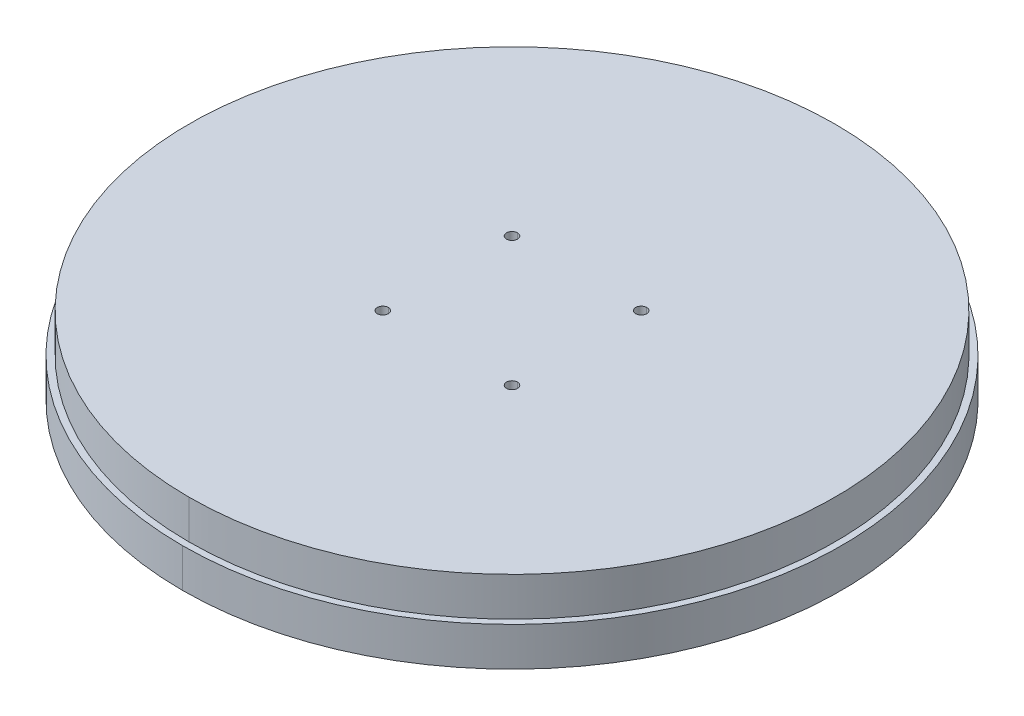
ISO-10303-21;
HEADER;
FILE_DESCRIPTION(('STEP AP214'),'2;1');
FILE_NAME('part.step','',(''),(''),'','','');
FILE_SCHEMA(('AUTOMOTIVE_DESIGN { 1 0 10303 214 1 1 1 1 }'));
ENDSEC;
DATA;
#1=APPLICATION_CONTEXT('core data for automotive mechanical design processes');
#2=APPLICATION_PROTOCOL_DEFINITION('international standard','automotive_design',2000,#1);
#3=PRODUCT_CONTEXT('',#1,'mechanical');
#4=PRODUCT('Part','Part','',(#3));
#5=PRODUCT_RELATED_PRODUCT_CATEGORY('part','',(#4));
#6=PRODUCT_DEFINITION_FORMATION('','',#4);
#7=PRODUCT_DEFINITION_CONTEXT('part definition',#1,'design');
#8=PRODUCT_DEFINITION('design','',#6,#7);
#9=PRODUCT_DEFINITION_SHAPE('','',#8);
#10=(LENGTH_UNIT() NAMED_UNIT(*) SI_UNIT(.MILLI.,.METRE.));
#11=(NAMED_UNIT(*) PLANE_ANGLE_UNIT() SI_UNIT($,.RADIAN.));
#12=(NAMED_UNIT(*) SI_UNIT($,.STERADIAN.) SOLID_ANGLE_UNIT());
#13=UNCERTAINTY_MEASURE_WITH_UNIT(LENGTH_MEASURE(1.E-05),#10,'distance_accuracy_value','');
#14=(GEOMETRIC_REPRESENTATION_CONTEXT(3) GLOBAL_UNCERTAINTY_ASSIGNED_CONTEXT((#13)) GLOBAL_UNIT_ASSIGNED_CONTEXT((#10,
#11,#12)) REPRESENTATION_CONTEXT('',''));
#15=CARTESIAN_POINT('',(0.,0.,0.));
#16=DIRECTION('',(0.,0.,1.));
#17=DIRECTION('',(1.,0.,0.));
#18=AXIS2_PLACEMENT_3D('',#15,#16,#17);
#19=CARTESIAN_POINT('',(202.09950971272,0.,-65.6661113046786));
#20=DIRECTION('',(0.,-1.,0.));
#21=DIRECTION('',(0.,0.,-1.));
#22=AXIS2_PLACEMENT_3D('',#19,#20,#21);
#23=CYLINDRICAL_SURFACE('',#22,5.1);
#24=CARTESIAN_POINT('',(202.09950971272,25.,-65.6661113046786));
#25=DIRECTION('',(0.,-1.,0.));
#26=DIRECTION('',(0.,0.,-1.));
#27=AXIS2_PLACEMENT_3D('',#24,#25,#26);
#28=CIRCLE('',#27,5.1);
#29=CARTESIAN_POINT('',(202.09950971272,25.,-60.5661113046786));
#30=VERTEX_POINT('',#29);
#31=CARTESIAN_POINT('',(202.09950971272,25.,-70.7661113046786));
#32=VERTEX_POINT('',#31);
#33=EDGE_CURVE('E41',#30,#32,#28,.T.);
#34=ORIENTED_EDGE('',*,*,#33,.F.);
#35=DIRECTION('',(0.,-1.,0.));
#36=VECTOR('',#35,1.);
#37=CARTESIAN_POINT('',(202.09950971272,0.,-60.5661113046786));
#38=LINE('',#37,#36);
#39=CARTESIAN_POINT('',(202.09950971272,0.,-60.5661113046786));
#40=VERTEX_POINT('',#39);
#41=EDGE_CURVE('E11',#30,#40,#38,.T.);
#42=ORIENTED_EDGE('',*,*,#41,.T.);
#43=CARTESIAN_POINT('',(202.09950971272,0.,-65.6661113046786));
#44=DIRECTION('',(0.,-1.,0.));
#45=DIRECTION('',(0.,0.,-1.));
#46=AXIS2_PLACEMENT_3D('',#43,#44,#45);
#47=CIRCLE('',#46,5.1);
#48=CARTESIAN_POINT('',(202.09950971272,0.,-70.7661113046786));
#49=VERTEX_POINT('',#48);
#50=EDGE_CURVE('E27',#40,#49,#47,.T.);
#51=ORIENTED_EDGE('',*,*,#50,.T.);
#52=DIRECTION('',(0.,-1.,0.));
#53=VECTOR('',#52,1.);
#54=CARTESIAN_POINT('',(202.09950971272,0.,-70.7661113046786));
#55=LINE('',#54,#53);
#56=EDGE_CURVE('E273',#32,#49,#55,.T.);
#57=ORIENTED_EDGE('',*,*,#56,.F.);
#58=EDGE_LOOP('',(#34,#42,#51,#57));
#59=FACE_BOUND('',#58,.T.);
#60=ADVANCED_FACE('F16',(#59),#23,.F.);
#61=CARTESIAN_POINT('',(202.09950971272,25.,-65.6661113046786));
#62=DIRECTION('',(0.,-1.,0.));
#63=DIRECTION('',(0.,0.,-1.));
#64=AXIS2_PLACEMENT_3D('',#61,#62,#63);
#65=CONICAL_SURFACE('',#64,5.1,1.02974425867665);
#66=DIRECTION('',(0.,-0.515038074910055,-0.857167300702112));
#67=VECTOR('',#66,1.);
#68=CARTESIAN_POINT('',(202.09950971272,25.,-70.7661113046786));
#69=LINE('',#68,#67);
#70=CARTESIAN_POINT('',(202.09950971272,28.0643891570405,-65.6661113046786));
#71=VERTEX_POINT('',#70);
#72=EDGE_CURVE('E147',#71,#32,#69,.T.);
#73=ORIENTED_EDGE('',*,*,#72,.F.);
#74=DIRECTION('',(0.,-0.515038074910055,0.857167300702112));
#75=VECTOR('',#74,1.);
#76=CARTESIAN_POINT('',(202.09950971272,25.,-60.5661113046786));
#77=LINE('',#76,#75);
#78=EDGE_CURVE('E285',#71,#30,#77,.T.);
#79=ORIENTED_EDGE('',*,*,#78,.T.);
#80=ORIENTED_EDGE('',*,*,#33,.T.);
#81=EDGE_LOOP('',(#73,#79,#80));
#82=FACE_BOUND('',#81,.T.);
#83=ADVANCED_FACE('F599',(#82),#65,.F.);
#84=CARTESIAN_POINT('',(124.904366112152,0.,171.916111304675));
#85=DIRECTION('',(0.,-1.,0.));
#86=DIRECTION('',(0.,0.,-1.));
#87=AXIS2_PLACEMENT_3D('',#84,#85,#86);
#88=CYLINDRICAL_SURFACE('',#87,5.1);
#89=CARTESIAN_POINT('',(124.904366112152,25.,171.916111304675));
#90=DIRECTION('',(0.,-1.,0.));
#91=DIRECTION('',(0.,0.,-1.));
#92=AXIS2_PLACEMENT_3D('',#89,#90,#91);
#93=CIRCLE('',#92,5.1);
#94=CARTESIAN_POINT('',(124.904366112152,25.,177.016111304675));
#95=VERTEX_POINT('',#94);
#96=CARTESIAN_POINT('',(124.904366112152,25.,166.816111304675));
#97=VERTEX_POINT('',#96);
#98=EDGE_CURVE('E161',#95,#97,#93,.T.);
#99=ORIENTED_EDGE('',*,*,#98,.F.);
#100=DIRECTION('',(0.,-1.,0.));
#101=VECTOR('',#100,1.);
#102=CARTESIAN_POINT('',(124.904366112152,0.,177.016111304675));
#103=LINE('',#102,#101);
#104=CARTESIAN_POINT('',(124.904366112152,0.,177.016111304675));
#105=VERTEX_POINT('',#104);
#106=EDGE_CURVE('E396',#95,#105,#103,.T.);
#107=ORIENTED_EDGE('',*,*,#106,.T.);
#108=CARTESIAN_POINT('',(124.904366112152,0.,171.916111304675));
#109=DIRECTION('',(0.,-1.,0.));
#110=DIRECTION('',(0.,0.,-1.));
#111=AXIS2_PLACEMENT_3D('',#108,#109,#110);
#112=CIRCLE('',#111,5.1);
#113=CARTESIAN_POINT('',(124.904366112152,0.,166.816111304675));
#114=VERTEX_POINT('',#113);
#115=EDGE_CURVE('E399',#105,#114,#112,.T.);
#116=ORIENTED_EDGE('',*,*,#115,.T.);
#117=DIRECTION('',(0.,-1.,0.));
#118=VECTOR('',#117,1.);
#119=CARTESIAN_POINT('',(124.904366112152,0.,166.816111304675));
#120=LINE('',#119,#118);
#121=EDGE_CURVE('E524',#97,#114,#120,.T.);
#122=ORIENTED_EDGE('',*,*,#121,.F.);
#123=EDGE_LOOP('',(#99,#107,#116,#122));
#124=FACE_BOUND('',#123,.T.);
#125=ADVANCED_FACE('F605',(#124),#88,.F.);
#126=CARTESIAN_POINT('',(124.904366112152,25.,171.916111304675));
#127=DIRECTION('',(0.,-1.,0.));
#128=DIRECTION('',(0.,0.,-1.));
#129=AXIS2_PLACEMENT_3D('',#126,#127,#128);
#130=CONICAL_SURFACE('',#129,5.1,1.02974425867665);
#131=DIRECTION('',(0.,-0.515038074910055,-0.857167300702112));
#132=VECTOR('',#131,1.);
#133=CARTESIAN_POINT('',(124.904366112152,25.,166.816111304675));
#134=LINE('',#133,#132);
#135=CARTESIAN_POINT('',(124.904366112152,28.0643891570405,171.916111304675));
#136=VERTEX_POINT('',#135);
#137=EDGE_CURVE('E499',#136,#97,#134,.T.);
#138=ORIENTED_EDGE('',*,*,#137,.F.);
#139=DIRECTION('',(0.,-0.515038074910055,0.857167300702112));
#140=VECTOR('',#139,1.);
#141=CARTESIAN_POINT('',(124.904366112152,25.,177.016111304675));
#142=LINE('',#141,#140);
#143=EDGE_CURVE('E520',#136,#95,#142,.T.);
#144=ORIENTED_EDGE('',*,*,#143,.T.);
#145=ORIENTED_EDGE('',*,*,#98,.T.);
#146=EDGE_LOOP('',(#138,#144,#145));
#147=FACE_BOUND('',#146,.T.);
#148=ADVANCED_FACE('F792',(#147),#130,.F.);
#149=CARTESIAN_POINT('',(-124.90436611215,0.,171.916111304677));
#150=DIRECTION('',(0.,-1.,0.));
#151=DIRECTION('',(0.,0.,-1.));
#152=AXIS2_PLACEMENT_3D('',#149,#150,#151);
#153=CYLINDRICAL_SURFACE('',#152,5.1);
#154=CARTESIAN_POINT('',(-124.90436611215,25.,171.916111304677));
#155=DIRECTION('',(0.,-1.,0.));
#156=DIRECTION('',(0.,0.,-1.));
#157=AXIS2_PLACEMENT_3D('',#154,#155,#156);
#158=CIRCLE('',#157,5.1);
#159=CARTESIAN_POINT('',(-124.90436611215,25.,177.016111304677));
#160=VERTEX_POINT('',#159);
#161=CARTESIAN_POINT('',(-124.90436611215,25.,166.816111304677));
#162=VERTEX_POINT('',#161);
#163=EDGE_CURVE('E420',#160,#162,#158,.T.);
#164=ORIENTED_EDGE('',*,*,#163,.F.);
#165=DIRECTION('',(0.,-1.,0.));
#166=VECTOR('',#165,1.);
#167=CARTESIAN_POINT('',(-124.90436611215,0.,177.016111304677));
#168=LINE('',#167,#166);
#169=CARTESIAN_POINT('',(-124.90436611215,0.,177.016111304677));
#170=VERTEX_POINT('',#169);
#171=EDGE_CURVE('E445',#160,#170,#168,.T.);
#172=ORIENTED_EDGE('',*,*,#171,.T.);
#173=CARTESIAN_POINT('',(-124.90436611215,0.,171.916111304677));
#174=DIRECTION('',(0.,-1.,0.));
#175=DIRECTION('',(0.,0.,-1.));
#176=AXIS2_PLACEMENT_3D('',#173,#174,#175);
#177=CIRCLE('',#176,5.1);
#178=CARTESIAN_POINT('',(-124.90436611215,0.,166.816111304677));
#179=VERTEX_POINT('',#178);
#180=EDGE_CURVE('E419',#170,#179,#177,.T.);
#181=ORIENTED_EDGE('',*,*,#180,.T.);
#182=DIRECTION('',(0.,-1.,0.));
#183=VECTOR('',#182,1.);
#184=CARTESIAN_POINT('',(-124.90436611215,0.,166.816111304677));
#185=LINE('',#184,#183);
#186=EDGE_CURVE('E455',#162,#179,#185,.T.);
#187=ORIENTED_EDGE('',*,*,#186,.F.);
#188=EDGE_LOOP('',(#164,#172,#181,#187));
#189=FACE_BOUND('',#188,.T.);
#190=ADVANCED_FACE('F788',(#189),#153,.F.);
#191=CARTESIAN_POINT('',(-124.90436611215,25.,171.916111304677));
#192=DIRECTION('',(0.,-1.,0.));
#193=DIRECTION('',(0.,0.,-1.));
#194=AXIS2_PLACEMENT_3D('',#191,#192,#193);
#195=CONICAL_SURFACE('',#194,5.1,1.02974425867665);
#196=DIRECTION('',(0.,-0.515038074910055,-0.857167300702112));
#197=VECTOR('',#196,1.);
#198=CARTESIAN_POINT('',(-124.90436611215,25.,166.816111304677));
#199=LINE('',#198,#197);
#200=CARTESIAN_POINT('',(-124.90436611215,28.0643891570405,171.916111304677));
#201=VERTEX_POINT('',#200);
#202=EDGE_CURVE('E482',#201,#162,#199,.T.);
#203=ORIENTED_EDGE('',*,*,#202,.F.);
#204=DIRECTION('',(0.,-0.515038074910055,0.857167300702112));
#205=VECTOR('',#204,1.);
#206=CARTESIAN_POINT('',(-124.90436611215,25.,177.016111304677));
#207=LINE('',#206,#205);
#208=EDGE_CURVE('E415',#201,#160,#207,.T.);
#209=ORIENTED_EDGE('',*,*,#208,.T.);
#210=ORIENTED_EDGE('',*,*,#163,.T.);
#211=EDGE_LOOP('',(#203,#209,#210));
#212=FACE_BOUND('',#211,.T.);
#213=ADVANCED_FACE('F659',(#212),#195,.F.);
#214=CARTESIAN_POINT('',(-202.099509712721,0.,-65.6661113046758));
#215=DIRECTION('',(0.,-1.,0.));
#216=DIRECTION('',(0.,0.,-1.));
#217=AXIS2_PLACEMENT_3D('',#214,#215,#216);
#218=CYLINDRICAL_SURFACE('',#217,5.1);
#219=CARTESIAN_POINT('',(-202.099509712721,25.,-65.6661113046758));
#220=DIRECTION('',(0.,-1.,0.));
#221=DIRECTION('',(0.,0.,-1.));
#222=AXIS2_PLACEMENT_3D('',#219,#220,#221);
#223=CIRCLE('',#222,5.1);
#224=CARTESIAN_POINT('',(-202.099509712721,25.,-60.5661113046758));
#225=VERTEX_POINT('',#224);
#226=CARTESIAN_POINT('',(-202.099509712721,25.,-70.7661113046758));
#227=VERTEX_POINT('',#226);
#228=EDGE_CURVE('E319',#225,#227,#223,.T.);
#229=ORIENTED_EDGE('',*,*,#228,.F.);
#230=DIRECTION('',(0.,-1.,0.));
#231=VECTOR('',#230,1.);
#232=CARTESIAN_POINT('',(-202.099509712721,0.,-60.5661113046758));
#233=LINE('',#232,#231);
#234=CARTESIAN_POINT('',(-202.099509712721,0.,-60.5661113046758));
#235=VERTEX_POINT('',#234);
#236=EDGE_CURVE('E405',#225,#235,#233,.T.);
#237=ORIENTED_EDGE('',*,*,#236,.T.);
#238=CARTESIAN_POINT('',(-202.099509712721,0.,-65.6661113046758));
#239=DIRECTION('',(0.,-1.,0.));
#240=DIRECTION('',(0.,0.,-1.));
#241=AXIS2_PLACEMENT_3D('',#238,#239,#240);
#242=CIRCLE('',#241,5.1);
#243=CARTESIAN_POINT('',(-202.099509712721,0.,-70.7661113046758));
#244=VERTEX_POINT('',#243);
#245=EDGE_CURVE('E318',#235,#244,#242,.T.);
#246=ORIENTED_EDGE('',*,*,#245,.T.);
#247=DIRECTION('',(0.,-1.,0.));
#248=VECTOR('',#247,1.);
#249=CARTESIAN_POINT('',(-202.099509712721,0.,-70.7661113046758));
#250=LINE('',#249,#248);
#251=EDGE_CURVE('E432',#227,#244,#250,.T.);
#252=ORIENTED_EDGE('',*,*,#251,.F.);
#253=EDGE_LOOP('',(#229,#237,#246,#252));
#254=FACE_BOUND('',#253,.T.);
#255=ADVANCED_FACE('F649',(#254),#218,.F.);
#256=CARTESIAN_POINT('',(-202.099509712721,25.,-65.6661113046758));
#257=DIRECTION('',(0.,-1.,0.));
#258=DIRECTION('',(0.,0.,-1.));
#259=AXIS2_PLACEMENT_3D('',#256,#257,#258);
#260=CONICAL_SURFACE('',#259,5.1,1.02974425867665);
#261=DIRECTION('',(0.,-0.515038074910055,-0.857167300702112));
#262=VECTOR('',#261,1.);
#263=CARTESIAN_POINT('',(-202.099509712721,25.,-70.7661113046758));
#264=LINE('',#263,#262);
#265=CARTESIAN_POINT('',(-202.099509712721,28.0643891570405,-65.6661113046758));
#266=VERTEX_POINT('',#265);
#267=EDGE_CURVE('E365',#266,#227,#264,.T.);
#268=ORIENTED_EDGE('',*,*,#267,.F.);
#269=DIRECTION('',(0.,-0.515038074910055,0.857167300702112));
#270=VECTOR('',#269,1.);
#271=CARTESIAN_POINT('',(-202.099509712721,25.,-60.5661113046758));
#272=LINE('',#271,#270);
#273=EDGE_CURVE('E314',#266,#225,#272,.T.);
#274=ORIENTED_EDGE('',*,*,#273,.T.);
#275=ORIENTED_EDGE('',*,*,#228,.T.);
#276=EDGE_LOOP('',(#268,#274,#275));
#277=FACE_BOUND('',#276,.T.);
#278=ADVANCED_FACE('F646',(#277),#260,.F.);
#279=CARTESIAN_POINT('',(0.,0.,-212.5));
#280=DIRECTION('',(0.,-1.,0.));
#281=DIRECTION('',(0.,0.,-1.));
#282=AXIS2_PLACEMENT_3D('',#279,#280,#281);
#283=CYLINDRICAL_SURFACE('',#282,5.1);
#284=CARTESIAN_POINT('',(0.,25.,-212.5));
#285=DIRECTION('',(0.,-1.,0.));
#286=DIRECTION('',(0.,0.,-1.));
#287=AXIS2_PLACEMENT_3D('',#284,#285,#286);
#288=CIRCLE('',#287,5.1);
#289=CARTESIAN_POINT('',(0.,25.,-207.4));
#290=VERTEX_POINT('',#289);
#291=CARTESIAN_POINT('',(0.,25.,-217.6));
#292=VERTEX_POINT('',#291);
#293=EDGE_CURVE('E332',#290,#292,#288,.T.);
#294=ORIENTED_EDGE('',*,*,#293,.F.);
#295=DIRECTION('',(0.,-1.,0.));
#296=VECTOR('',#295,1.);
#297=CARTESIAN_POINT('',(0.,0.,-207.4));
#298=LINE('',#297,#296);
#299=CARTESIAN_POINT('',(0.,0.,-207.4));
#300=VERTEX_POINT('',#299);
#301=EDGE_CURVE('E437',#290,#300,#298,.T.);
#302=ORIENTED_EDGE('',*,*,#301,.T.);
#303=CARTESIAN_POINT('',(0.,0.,-212.5));
#304=DIRECTION('',(0.,-1.,0.));
#305=DIRECTION('',(0.,0.,-1.));
#306=AXIS2_PLACEMENT_3D('',#303,#304,#305);
#307=CIRCLE('',#306,5.1);
#308=CARTESIAN_POINT('',(0.,0.,-217.6));
#309=VERTEX_POINT('',#308);
#310=EDGE_CURVE('E433',#300,#309,#307,.T.);
#311=ORIENTED_EDGE('',*,*,#310,.T.);
#312=DIRECTION('',(0.,-1.,0.));
#313=VECTOR('',#312,1.);
#314=CARTESIAN_POINT('',(0.,0.,-217.6));
#315=LINE('',#314,#313);
#316=EDGE_CURVE('E327',#292,#309,#315,.T.);
#317=ORIENTED_EDGE('',*,*,#316,.F.);
#318=EDGE_LOOP('',(#294,#302,#311,#317));
#319=FACE_BOUND('',#318,.T.);
#320=ADVANCED_FACE('F648',(#319),#283,.F.);
#321=CARTESIAN_POINT('',(0.,25.,-212.5));
#322=DIRECTION('',(0.,-1.,0.));
#323=DIRECTION('',(0.,0.,-1.));
#324=AXIS2_PLACEMENT_3D('',#321,#322,#323);
#325=CONICAL_SURFACE('',#324,5.1,1.02974425867665);
#326=DIRECTION('',(0.,-0.515038074910055,-0.857167300702112));
#327=VECTOR('',#326,1.);
#328=CARTESIAN_POINT('',(0.,25.,-217.6));
#329=LINE('',#328,#327);
#330=CARTESIAN_POINT('',(0.,28.0643891570405,-212.5));
#331=VERTEX_POINT('',#330);
#332=EDGE_CURVE('E466',#331,#292,#329,.T.);
#333=ORIENTED_EDGE('',*,*,#332,.F.);
#334=DIRECTION('',(0.,-0.515038074910055,0.857167300702112));
#335=VECTOR('',#334,1.);
#336=CARTESIAN_POINT('',(0.,25.,-207.4));
#337=LINE('',#336,#335);
#338=EDGE_CURVE('E336',#331,#290,#337,.T.);
#339=ORIENTED_EDGE('',*,*,#338,.T.);
#340=ORIENTED_EDGE('',*,*,#293,.T.);
#341=EDGE_LOOP('',(#333,#339,#340));
#342=FACE_BOUND('',#341,.T.);
#343=ADVANCED_FACE('F656',(#342),#325,.F.);
#344=CARTESIAN_POINT('',(50.,60.,50.));
#345=DIRECTION('',(0.,1.,0.));
#346=DIRECTION('',(0.,0.,1.));
#347=AXIS2_PLACEMENT_3D('',#344,#345,#346);
#348=CYLINDRICAL_SURFACE('',#347,4.25);
#349=CARTESIAN_POINT('',(50.,30.,50.));
#350=DIRECTION('',(0.,1.,0.));
#351=DIRECTION('',(0.,0.,1.));
#352=AXIS2_PLACEMENT_3D('',#349,#350,#351);
#353=CIRCLE('',#352,4.25);
#354=CARTESIAN_POINT('',(50.,30.,45.75));
#355=VERTEX_POINT('',#354);
#356=CARTESIAN_POINT('',(50.,30.,54.25));
#357=VERTEX_POINT('',#356);
#358=EDGE_CURVE('E453',#355,#357,#353,.T.);
#359=ORIENTED_EDGE('',*,*,#358,.F.);
#360=DIRECTION('',(0.,1.,0.));
#361=VECTOR('',#360,1.);
#362=CARTESIAN_POINT('',(50.,60.,45.75));
#363=LINE('',#362,#361);
#364=CARTESIAN_POINT('',(50.,60.,45.75));
#365=VERTEX_POINT('',#364);
#366=EDGE_CURVE('E337',#355,#365,#363,.T.);
#367=ORIENTED_EDGE('',*,*,#366,.T.);
#368=CARTESIAN_POINT('',(50.,60.,50.));
#369=DIRECTION('',(0.,1.,0.));
#370=DIRECTION('',(0.,0.,1.));
#371=AXIS2_PLACEMENT_3D('',#368,#369,#370);
#372=CIRCLE('',#371,4.25);
#373=CARTESIAN_POINT('',(50.,60.,54.25));
#374=VERTEX_POINT('',#373);
#375=EDGE_CURVE('E385',#365,#374,#372,.T.);
#376=ORIENTED_EDGE('',*,*,#375,.T.);
#377=DIRECTION('',(0.,1.,0.));
#378=VECTOR('',#377,1.);
#379=CARTESIAN_POINT('',(50.,60.,54.25));
#380=LINE('',#379,#378);
#381=EDGE_CURVE('E428',#357,#374,#380,.T.);
#382=ORIENTED_EDGE('',*,*,#381,.F.);
#383=EDGE_LOOP('',(#359,#367,#376,#382));
#384=FACE_BOUND('',#383,.T.);
#385=ADVANCED_FACE('F888',(#384),#348,.F.);
#386=CARTESIAN_POINT('',(50.,30.,50.));
#387=DIRECTION('',(0.,1.,0.));
#388=DIRECTION('',(0.,0.,1.));
#389=AXIS2_PLACEMENT_3D('',#386,#387,#388);
#390=CONICAL_SURFACE('',#389,4.25,1.02974425867665);
#391=DIRECTION('',(0.,0.515038074910055,0.857167300702112));
#392=VECTOR('',#391,1.);
#393=CARTESIAN_POINT('',(50.,30.,54.25));
#394=LINE('',#393,#392);
#395=CARTESIAN_POINT('',(50.,27.4463423691328,50.));
#396=VERTEX_POINT('',#395);
#397=EDGE_CURVE('E379',#396,#357,#394,.T.);
#398=ORIENTED_EDGE('',*,*,#397,.F.);
#399=DIRECTION('',(0.,0.515038074910055,-0.857167300702112));
#400=VECTOR('',#399,1.);
#401=CARTESIAN_POINT('',(50.,30.,45.75));
#402=LINE('',#401,#400);
#403=EDGE_CURVE('E472',#396,#355,#402,.T.);
#404=ORIENTED_EDGE('',*,*,#403,.T.);
#405=ORIENTED_EDGE('',*,*,#358,.T.);
#406=EDGE_LOOP('',(#398,#404,#405));
#407=FACE_BOUND('',#406,.T.);
#408=ADVANCED_FACE('F644',(#407),#390,.F.);
#409=CARTESIAN_POINT('',(-50.,60.,50.));
#410=DIRECTION('',(0.,1.,0.));
#411=DIRECTION('',(0.,0.,1.));
#412=AXIS2_PLACEMENT_3D('',#409,#410,#411);
#413=CYLINDRICAL_SURFACE('',#412,4.25);
#414=CARTESIAN_POINT('',(-50.,30.,50.));
#415=DIRECTION('',(0.,1.,0.));
#416=DIRECTION('',(0.,0.,1.));
#417=AXIS2_PLACEMENT_3D('',#414,#415,#416);
#418=CIRCLE('',#417,4.25);
#419=CARTESIAN_POINT('',(-50.,30.,45.75));
#420=VERTEX_POINT('',#419);
#421=CARTESIAN_POINT('',(-50.,30.,54.25));
#422=VERTEX_POINT('',#421);
#423=EDGE_CURVE('E409',#420,#422,#418,.T.);
#424=ORIENTED_EDGE('',*,*,#423,.F.);
#425=DIRECTION('',(0.,1.,0.));
#426=VECTOR('',#425,1.);
#427=CARTESIAN_POINT('',(-50.,60.,45.75));
#428=LINE('',#427,#426);
#429=CARTESIAN_POINT('',(-50.,60.,45.75));
#430=VERTEX_POINT('',#429);
#431=EDGE_CURVE('E449',#420,#430,#428,.T.);
#432=ORIENTED_EDGE('',*,*,#431,.T.);
#433=CARTESIAN_POINT('',(-50.,60.,50.));
#434=DIRECTION('',(0.,1.,0.));
#435=DIRECTION('',(0.,0.,1.));
#436=AXIS2_PLACEMENT_3D('',#433,#434,#435);
#437=CIRCLE('',#436,4.25);
#438=CARTESIAN_POINT('',(-50.,60.,54.25));
#439=VERTEX_POINT('',#438);
#440=EDGE_CURVE('E454',#430,#439,#437,.T.);
#441=ORIENTED_EDGE('',*,*,#440,.T.);
#442=DIRECTION('',(0.,1.,0.));
#443=VECTOR('',#442,1.);
#444=CARTESIAN_POINT('',(-50.,60.,54.25));
#445=LINE('',#444,#443);
#446=EDGE_CURVE('E350',#422,#439,#445,.T.);
#447=ORIENTED_EDGE('',*,*,#446,.F.);
#448=EDGE_LOOP('',(#424,#432,#441,#447));
#449=FACE_BOUND('',#448,.T.);
#450=ADVANCED_FACE('F642',(#449),#413,.F.);
#451=CARTESIAN_POINT('',(-50.,30.,50.));
#452=DIRECTION('',(0.,1.,0.));
#453=DIRECTION('',(0.,0.,1.));
#454=AXIS2_PLACEMENT_3D('',#451,#452,#453);
#455=CONICAL_SURFACE('',#454,4.25,1.02974425867665);
#456=DIRECTION('',(0.,0.515038074910055,0.857167300702112));
#457=VECTOR('',#456,1.);
#458=CARTESIAN_POINT('',(-50.,30.,54.25));
#459=LINE('',#458,#457);
#460=CARTESIAN_POINT('',(-50.,27.4463423691328,50.));
#461=VERTEX_POINT('',#460);
#462=EDGE_CURVE('E308',#461,#422,#459,.T.);
#463=ORIENTED_EDGE('',*,*,#462,.F.);
#464=DIRECTION('',(0.,0.515038074910055,-0.857167300702112));
#465=VECTOR('',#464,1.);
#466=CARTESIAN_POINT('',(-50.,30.,45.75));
#467=LINE('',#466,#465);
#468=EDGE_CURVE('E413',#461,#420,#467,.T.);
#469=ORIENTED_EDGE('',*,*,#468,.T.);
#470=ORIENTED_EDGE('',*,*,#423,.T.);
#471=EDGE_LOOP('',(#463,#469,#470));
#472=FACE_BOUND('',#471,.T.);
#473=ADVANCED_FACE('F594',(#472),#455,.F.);
#474=CARTESIAN_POINT('',(-50.,60.,-50.));
#475=DIRECTION('',(0.,1.,0.));
#476=DIRECTION('',(0.,0.,1.));
#477=AXIS2_PLACEMENT_3D('',#474,#475,#476);
#478=CYLINDRICAL_SURFACE('',#477,4.25);
#479=CARTESIAN_POINT('',(-50.,30.,-50.));
#480=DIRECTION('',(0.,1.,0.));
#481=DIRECTION('',(0.,0.,1.));
#482=AXIS2_PLACEMENT_3D('',#479,#480,#481);
#483=CIRCLE('',#482,4.25);
#484=CARTESIAN_POINT('',(-50.,30.,-54.25));
#485=VERTEX_POINT('',#484);
#486=CARTESIAN_POINT('',(-50.,30.,-45.75));
#487=VERTEX_POINT('',#486);
#488=EDGE_CURVE('E356',#485,#487,#483,.T.);
#489=ORIENTED_EDGE('',*,*,#488,.F.);
#490=DIRECTION('',(0.,1.,0.));
#491=VECTOR('',#490,1.);
#492=CARTESIAN_POINT('',(-50.,60.,-54.25));
#493=LINE('',#492,#491);
#494=CARTESIAN_POINT('',(-50.,60.,-54.25));
#495=VERTEX_POINT('',#494);
#496=EDGE_CURVE('E414',#485,#495,#493,.T.);
#497=ORIENTED_EDGE('',*,*,#496,.T.);
#498=CARTESIAN_POINT('',(-50.,60.,-50.));
#499=DIRECTION('',(0.,1.,0.));
#500=DIRECTION('',(0.,0.,1.));
#501=AXIS2_PLACEMENT_3D('',#498,#499,#500);
#502=CIRCLE('',#501,4.25);
#503=CARTESIAN_POINT('',(-50.,60.,-45.75));
#504=VERTEX_POINT('',#503);
#505=EDGE_CURVE('E355',#495,#504,#502,.T.);
#506=ORIENTED_EDGE('',*,*,#505,.T.);
#507=DIRECTION('',(0.,1.,0.));
#508=VECTOR('',#507,1.);
#509=CARTESIAN_POINT('',(-50.,60.,-45.75));
#510=LINE('',#509,#508);
#511=EDGE_CURVE('E307',#487,#504,#510,.T.);
#512=ORIENTED_EDGE('',*,*,#511,.F.);
#513=EDGE_LOOP('',(#489,#497,#506,#512));
#514=FACE_BOUND('',#513,.T.);
#515=ADVANCED_FACE('F570',(#514),#478,.F.);
#516=CARTESIAN_POINT('',(-50.,30.,-50.));
#517=DIRECTION('',(0.,1.,0.));
#518=DIRECTION('',(0.,0.,1.));
#519=AXIS2_PLACEMENT_3D('',#516,#517,#518);
#520=CONICAL_SURFACE('',#519,4.25,1.02974425867665);
#521=DIRECTION('',(0.,0.515038074910055,0.857167300702112));
#522=VECTOR('',#521,1.);
#523=CARTESIAN_POINT('',(-50.,30.,-45.75));
#524=LINE('',#523,#522);
#525=CARTESIAN_POINT('',(-50.,27.4463423691328,-50.));
#526=VERTEX_POINT('',#525);
#527=EDGE_CURVE('E306',#526,#487,#524,.T.);
#528=ORIENTED_EDGE('',*,*,#527,.F.);
#529=DIRECTION('',(0.,0.515038074910055,-0.857167300702112));
#530=VECTOR('',#529,1.);
#531=CARTESIAN_POINT('',(-50.,30.,-54.25));
#532=LINE('',#531,#530);
#533=EDGE_CURVE('E351',#526,#485,#532,.T.);
#534=ORIENTED_EDGE('',*,*,#533,.T.);
#535=ORIENTED_EDGE('',*,*,#488,.T.);
#536=EDGE_LOOP('',(#528,#534,#535));
#537=FACE_BOUND('',#536,.T.);
#538=ADVANCED_FACE('F582',(#537),#520,.F.);
#539=CARTESIAN_POINT('',(50.,60.,-50.));
#540=DIRECTION('',(0.,1.,0.));
#541=DIRECTION('',(0.,0.,1.));
#542=AXIS2_PLACEMENT_3D('',#539,#540,#541);
#543=CYLINDRICAL_SURFACE('',#542,4.25);
#544=CARTESIAN_POINT('',(50.,30.,-50.));
#545=DIRECTION('',(0.,1.,0.));
#546=DIRECTION('',(0.,0.,1.));
#547=AXIS2_PLACEMENT_3D('',#544,#545,#546);
#548=CIRCLE('',#547,4.25);
#549=CARTESIAN_POINT('',(50.,30.,-54.25));
#550=VERTEX_POINT('',#549);
#551=CARTESIAN_POINT('',(50.,30.,-45.75));
#552=VERTEX_POINT('',#551);
#553=EDGE_CURVE('E338',#550,#552,#548,.T.);
#554=ORIENTED_EDGE('',*,*,#553,.F.);
#555=DIRECTION('',(0.,1.,0.));
#556=VECTOR('',#555,1.);
#557=CARTESIAN_POINT('',(50.,60.,-54.25));
#558=LINE('',#557,#556);
#559=CARTESIAN_POINT('',(50.,60.,-54.25));
#560=VERTEX_POINT('',#559);
#561=EDGE_CURVE('E357',#550,#560,#558,.T.);
#562=ORIENTED_EDGE('',*,*,#561,.T.);
#563=CARTESIAN_POINT('',(50.,60.,-50.));
#564=DIRECTION('',(0.,1.,0.));
#565=DIRECTION('',(0.,0.,1.));
#566=AXIS2_PLACEMENT_3D('',#563,#564,#565);
#567=CIRCLE('',#566,4.25);
#568=CARTESIAN_POINT('',(50.,60.,-45.75));
#569=VERTEX_POINT('',#568);
#570=EDGE_CURVE('E361',#560,#569,#567,.T.);
#571=ORIENTED_EDGE('',*,*,#570,.T.);
#572=DIRECTION('',(0.,1.,0.));
#573=VECTOR('',#572,1.);
#574=CARTESIAN_POINT('',(50.,60.,-45.75));
#575=LINE('',#574,#573);
#576=EDGE_CURVE('E202',#552,#569,#575,.T.);
#577=ORIENTED_EDGE('',*,*,#576,.F.);
#578=EDGE_LOOP('',(#554,#562,#571,#577));
#579=FACE_BOUND('',#578,.T.);
#580=ADVANCED_FACE('F584',(#579),#543,.F.);
#581=CARTESIAN_POINT('',(50.,30.,-50.));
#582=DIRECTION('',(0.,1.,0.));
#583=DIRECTION('',(0.,0.,1.));
#584=AXIS2_PLACEMENT_3D('',#581,#582,#583);
#585=CONICAL_SURFACE('',#584,4.25,1.02974425867665);
#586=DIRECTION('',(0.,0.515038074910055,0.857167300702112));
#587=VECTOR('',#586,1.);
#588=CARTESIAN_POINT('',(50.,30.,-45.75));
#589=LINE('',#588,#587);
#590=CARTESIAN_POINT('',(50.,27.4463423691328,-50.));
#591=VERTEX_POINT('',#590);
#592=EDGE_CURVE('E190',#591,#552,#589,.T.);
#593=ORIENTED_EDGE('',*,*,#592,.F.);
#594=DIRECTION('',(0.,0.515038074910055,-0.857167300702112));
#595=VECTOR('',#594,1.);
#596=CARTESIAN_POINT('',(50.,30.,-54.25));
#597=LINE('',#596,#595);
#598=EDGE_CURVE('E341',#591,#550,#597,.T.);
#599=ORIENTED_EDGE('',*,*,#598,.T.);
#600=ORIENTED_EDGE('',*,*,#553,.T.);
#601=EDGE_LOOP('',(#593,#599,#600));
#602=FACE_BOUND('',#601,.T.);
#603=ADVANCED_FACE('F592',(#602),#585,.F.);
#604=CARTESIAN_POINT('',(0.,60.,0.));
#605=DIRECTION('',(0.,-1.,0.));
#606=DIRECTION('',(0.,0.,-1.));
#607=AXIS2_PLACEMENT_3D('',#604,#605,#606);
#608=CYLINDRICAL_SURFACE('',#607,250.);
#609=CARTESIAN_POINT('',(0.,60.,0.));
#610=DIRECTION('',(0.,1.,0.));
#611=DIRECTION('',(0.,0.,1.));
#612=AXIS2_PLACEMENT_3D('',#609,#610,#611);
#613=CIRCLE('',#612,250.);
#614=CARTESIAN_POINT('',(0.,60.,250.));
#615=VERTEX_POINT('',#614);
#616=CARTESIAN_POINT('',(0.,60.,-250.));
#617=VERTEX_POINT('',#616);
#618=EDGE_CURVE('E298',#615,#617,#613,.T.);
#619=ORIENTED_EDGE('',*,*,#618,.F.);
#620=DIRECTION('',(0.,-1.,0.));
#621=VECTOR('',#620,1.);
#622=CARTESIAN_POINT('',(0.,60.,250.));
#623=LINE('',#622,#621);
#624=CARTESIAN_POINT('',(0.,30.,250.));
#625=VERTEX_POINT('',#624);
#626=EDGE_CURVE('E342',#615,#625,#623,.T.);
#627=ORIENTED_EDGE('',*,*,#626,.T.);
#628=CARTESIAN_POINT('',(0.,30.,0.));
#629=DIRECTION('',(0.,1.,0.));
#630=DIRECTION('',(0.,0.,1.));
#631=AXIS2_PLACEMENT_3D('',#628,#629,#630);
#632=CIRCLE('',#631,250.);
#633=CARTESIAN_POINT('',(0.,30.,-250.));
#634=VERTEX_POINT('',#633);
#635=EDGE_CURVE('E346',#625,#634,#632,.T.);
#636=ORIENTED_EDGE('',*,*,#635,.T.);
#637=DIRECTION('',(0.,-1.,0.));
#638=VECTOR('',#637,1.);
#639=CARTESIAN_POINT('',(0.,60.,-250.));
#640=LINE('',#639,#638);
#641=EDGE_CURVE('E406',#617,#634,#640,.T.);
#642=ORIENTED_EDGE('',*,*,#641,.F.);
#643=EDGE_LOOP('',(#619,#627,#636,#642));
#644=FACE_BOUND('',#643,.T.);
#645=ADVANCED_FACE('F1031',(#644),#608,.T.);
#646=CARTESIAN_POINT('',(0.,30.,0.));
#647=DIRECTION('',(0.,-1.,0.));
#648=DIRECTION('',(0.,0.,-1.));
#649=AXIS2_PLACEMENT_3D('',#646,#647,#648);
#650=CYLINDRICAL_SURFACE('',#649,255.);
#651=CARTESIAN_POINT('',(0.,30.,0.));
#652=DIRECTION('',(0.,1.,0.));
#653=DIRECTION('',(0.,0.,1.));
#654=AXIS2_PLACEMENT_3D('',#651,#652,#653);
#655=CIRCLE('',#654,255.);
#656=CARTESIAN_POINT('',(0.,30.,255.));
#657=VERTEX_POINT('',#656);
#658=CARTESIAN_POINT('',(0.,30.,-255.));
#659=VERTEX_POINT('',#658);
#660=EDGE_CURVE('E20',#657,#659,#655,.T.);
#661=ORIENTED_EDGE('',*,*,#660,.F.);
#662=DIRECTION('',(0.,-1.,0.));
#663=VECTOR('',#662,1.);
#664=CARTESIAN_POINT('',(0.,30.,255.));
#665=LINE('',#664,#663);
#666=CARTESIAN_POINT('',(0.,0.,255.));
#667=VERTEX_POINT('',#666);
#668=EDGE_CURVE('E374',#657,#667,#665,.T.);
#669=ORIENTED_EDGE('',*,*,#668,.T.);
#670=CARTESIAN_POINT('',(0.,0.,0.));
#671=DIRECTION('',(0.,1.,0.));
#672=DIRECTION('',(0.,0.,1.));
#673=AXIS2_PLACEMENT_3D('',#670,#671,#672);
#674=CIRCLE('',#673,255.);
#675=CARTESIAN_POINT('',(0.,0.,-255.));
#676=VERTEX_POINT('',#675);
#677=EDGE_CURVE('E370',#667,#676,#674,.T.);
#678=ORIENTED_EDGE('',*,*,#677,.T.);
#679=DIRECTION('',(0.,-1.,0.));
#680=VECTOR('',#679,1.);
#681=CARTESIAN_POINT('',(0.,30.,-255.));
#682=LINE('',#681,#680);
#683=EDGE_CURVE('E375',#659,#676,#682,.T.);
#684=ORIENTED_EDGE('',*,*,#683,.F.);
#685=EDGE_LOOP('',(#661,#669,#678,#684));
#686=FACE_BOUND('',#685,.T.);
#687=ADVANCED_FACE('F942',(#686),#650,.T.);
#688=CARTESIAN_POINT('',(0.,30.,0.));
#689=DIRECTION('',(0.,-1.,0.));
#690=DIRECTION('',(0.,0.,-1.));
#691=AXIS2_PLACEMENT_3D('',#688,#689,#690);
#692=CYLINDRICAL_SURFACE('',#691,255.);
#693=ORIENTED_EDGE('',*,*,#668,.F.);
#694=CARTESIAN_POINT('',(0.,30.,0.));
#695=DIRECTION('',(0.,1.,0.));
#696=DIRECTION('',(0.,0.,1.));
#697=AXIS2_PLACEMENT_3D('',#694,#695,#696);
#698=CIRCLE('',#697,255.);
#699=EDGE_CURVE('E510',#659,#657,#698,.T.);
#700=ORIENTED_EDGE('',*,*,#699,.F.);
#701=ORIENTED_EDGE('',*,*,#683,.T.);
#702=CARTESIAN_POINT('',(0.,0.,0.));
#703=DIRECTION('',(0.,1.,0.));
#704=DIRECTION('',(0.,0.,1.));
#705=AXIS2_PLACEMENT_3D('',#702,#703,#704);
#706=CIRCLE('',#705,255.);
#707=EDGE_CURVE('E489',#676,#667,#706,.T.);
#708=ORIENTED_EDGE('',*,*,#707,.T.);
#709=EDGE_LOOP('',(#693,#700,#701,#708));
#710=FACE_BOUND('',#709,.T.);
#711=ADVANCED_FACE('F939',(#710),#692,.T.);
#712=CARTESIAN_POINT('',(0.,30.,0.));
#713=DIRECTION('',(0.,1.,0.));
#714=DIRECTION('',(1.,0.,0.));
#715=AXIS2_PLACEMENT_3D('',#712,#713,#714);
#716=PLANE('',#715);
#717=ORIENTED_EDGE('',*,*,#699,.T.);
#718=ORIENTED_EDGE('',*,*,#660,.T.);
#719=EDGE_LOOP('',(#717,#718));
#720=FACE_BOUND('',#719,.T.);
#721=CARTESIAN_POINT('',(0.,30.,0.));
#722=DIRECTION('',(0.,1.,0.));
#723=DIRECTION('',(0.,0.,1.));
#724=AXIS2_PLACEMENT_3D('',#721,#722,#723);
#725=CIRCLE('',#724,250.);
#726=EDGE_CURVE('E296',#634,#625,#725,.T.);
#727=ORIENTED_EDGE('',*,*,#726,.F.);
#728=ORIENTED_EDGE('',*,*,#635,.F.);
#729=EDGE_LOOP('',(#727,#728));
#730=FACE_BOUND('',#729,.T.);
#731=ADVANCED_FACE('F635',(#720,#730),#716,.T.);
#732=CARTESIAN_POINT('',(0.,0.,0.));
#733=DIRECTION('',(0.,1.,0.));
#734=DIRECTION('',(1.,0.,0.));
#735=AXIS2_PLACEMENT_3D('',#732,#733,#734);
#736=PLANE('',#735);
#737=ORIENTED_EDGE('',*,*,#707,.F.);
#738=ORIENTED_EDGE('',*,*,#677,.F.);
#739=EDGE_LOOP('',(#737,#738));
#740=FACE_BOUND('',#739,.T.);
#741=CARTESIAN_POINT('',(202.09950971272,0.,-65.6661113046786));
#742=DIRECTION('',(0.,-1.,0.));
#743=DIRECTION('',(0.,0.,-1.));
#744=AXIS2_PLACEMENT_3D('',#741,#742,#743);
#745=CIRCLE('',#744,5.1);
#746=EDGE_CURVE('E278',#49,#40,#745,.T.);
#747=ORIENTED_EDGE('',*,*,#746,.F.);
#748=ORIENTED_EDGE('',*,*,#50,.F.);
#749=EDGE_LOOP('',(#747,#748));
#750=FACE_BOUND('',#749,.T.);
#751=CARTESIAN_POINT('',(124.904366112152,0.,171.916111304675));
#752=DIRECTION('',(0.,-1.,0.));
#753=DIRECTION('',(0.,0.,-1.));
#754=AXIS2_PLACEMENT_3D('',#751,#752,#753);
#755=CIRCLE('',#754,5.1);
#756=EDGE_CURVE('E475',#114,#105,#755,.T.);
#757=ORIENTED_EDGE('',*,*,#756,.F.);
#758=ORIENTED_EDGE('',*,*,#115,.F.);
#759=EDGE_LOOP('',(#757,#758));
#760=FACE_BOUND('',#759,.T.);
#761=CARTESIAN_POINT('',(-124.90436611215,0.,171.916111304677));
#762=DIRECTION('',(0.,-1.,0.));
#763=DIRECTION('',(0.,0.,-1.));
#764=AXIS2_PLACEMENT_3D('',#761,#762,#763);
#765=CIRCLE('',#764,5.1);
#766=EDGE_CURVE('E459',#179,#170,#765,.T.);
#767=ORIENTED_EDGE('',*,*,#766,.F.);
#768=ORIENTED_EDGE('',*,*,#180,.F.);
#769=EDGE_LOOP('',(#767,#768));
#770=FACE_BOUND('',#769,.T.);
#771=CARTESIAN_POINT('',(-202.099509712721,0.,-65.6661113046758));
#772=DIRECTION('',(0.,-1.,0.));
#773=DIRECTION('',(0.,0.,-1.));
#774=AXIS2_PLACEMENT_3D('',#771,#772,#773);
#775=CIRCLE('',#774,5.1);
#776=EDGE_CURVE('E486',#244,#235,#775,.T.);
#777=ORIENTED_EDGE('',*,*,#776,.F.);
#778=ORIENTED_EDGE('',*,*,#245,.F.);
#779=EDGE_LOOP('',(#777,#778));
#780=FACE_BOUND('',#779,.T.);
#781=CARTESIAN_POINT('',(0.,0.,-212.5));
#782=DIRECTION('',(0.,-1.,0.));
#783=DIRECTION('',(0.,0.,-1.));
#784=AXIS2_PLACEMENT_3D('',#781,#782,#783);
#785=CIRCLE('',#784,5.1);
#786=EDGE_CURVE('E331',#309,#300,#785,.T.);
#787=ORIENTED_EDGE('',*,*,#786,.F.);
#788=ORIENTED_EDGE('',*,*,#310,.F.);
#789=EDGE_LOOP('',(#787,#788));
#790=FACE_BOUND('',#789,.T.);
#791=ADVANCED_FACE('F287',(#740,#750,#760,#770,#780,#790),#736,.F.);
#792=CARTESIAN_POINT('',(0.,60.,0.));
#793=DIRECTION('',(0.,-1.,0.));
#794=DIRECTION('',(0.,0.,-1.));
#795=AXIS2_PLACEMENT_3D('',#792,#793,#794);
#796=CYLINDRICAL_SURFACE('',#795,250.);
#797=ORIENTED_EDGE('',*,*,#626,.F.);
#798=CARTESIAN_POINT('',(0.,60.,0.));
#799=DIRECTION('',(0.,1.,0.));
#800=DIRECTION('',(0.,0.,1.));
#801=AXIS2_PLACEMENT_3D('',#798,#799,#800);
#802=CIRCLE('',#801,250.);
#803=EDGE_CURVE('E301',#617,#615,#802,.T.);
#804=ORIENTED_EDGE('',*,*,#803,.F.);
#805=ORIENTED_EDGE('',*,*,#641,.T.);
#806=ORIENTED_EDGE('',*,*,#726,.T.);
#807=EDGE_LOOP('',(#797,#804,#805,#806));
#808=FACE_BOUND('',#807,.T.);
#809=ADVANCED_FACE('F634',(#808),#796,.T.);
#810=CARTESIAN_POINT('',(0.,60.,0.));
#811=DIRECTION('',(0.,1.,0.));
#812=DIRECTION('',(1.,0.,0.));
#813=AXIS2_PLACEMENT_3D('',#810,#811,#812);
#814=PLANE('',#813);
#815=ORIENTED_EDGE('',*,*,#803,.T.);
#816=ORIENTED_EDGE('',*,*,#618,.T.);
#817=EDGE_LOOP('',(#815,#816));
#818=FACE_BOUND('',#817,.T.);
#819=CARTESIAN_POINT('',(50.,60.,50.));
#820=DIRECTION('',(0.,1.,0.));
#821=DIRECTION('',(0.,0.,1.));
#822=AXIS2_PLACEMENT_3D('',#819,#820,#821);
#823=CIRCLE('',#822,4.25);
#824=EDGE_CURVE('E444',#374,#365,#823,.T.);
#825=ORIENTED_EDGE('',*,*,#824,.F.);
#826=ORIENTED_EDGE('',*,*,#375,.F.);
#827=EDGE_LOOP('',(#825,#826));
#828=FACE_BOUND('',#827,.T.);
#829=CARTESIAN_POINT('',(-50.,60.,50.));
#830=DIRECTION('',(0.,1.,0.));
#831=DIRECTION('',(0.,0.,1.));
#832=AXIS2_PLACEMENT_3D('',#829,#830,#831);
#833=CIRCLE('',#832,4.25);
#834=EDGE_CURVE('E364',#439,#430,#833,.T.);
#835=ORIENTED_EDGE('',*,*,#834,.F.);
#836=ORIENTED_EDGE('',*,*,#440,.F.);
#837=EDGE_LOOP('',(#835,#836));
#838=FACE_BOUND('',#837,.T.);
#839=CARTESIAN_POINT('',(-50.,60.,-50.));
#840=DIRECTION('',(0.,1.,0.));
#841=DIRECTION('',(0.,0.,1.));
#842=AXIS2_PLACEMENT_3D('',#839,#840,#841);
#843=CIRCLE('',#842,4.25);
#844=EDGE_CURVE('E311',#504,#495,#843,.T.);
#845=ORIENTED_EDGE('',*,*,#844,.F.);
#846=ORIENTED_EDGE('',*,*,#505,.F.);
#847=EDGE_LOOP('',(#845,#846));
#848=FACE_BOUND('',#847,.T.);
#849=CARTESIAN_POINT('',(50.,60.,-50.));
#850=DIRECTION('',(0.,1.,0.));
#851=DIRECTION('',(0.,0.,1.));
#852=AXIS2_PLACEMENT_3D('',#849,#850,#851);
#853=CIRCLE('',#852,4.25);
#854=EDGE_CURVE('E323',#569,#560,#853,.T.);
#855=ORIENTED_EDGE('',*,*,#854,.F.);
#856=ORIENTED_EDGE('',*,*,#570,.F.);
#857=EDGE_LOOP('',(#855,#856));
#858=FACE_BOUND('',#857,.T.);
#859=ADVANCED_FACE('F573',(#818,#828,#838,#848,#858),#814,.T.);
#860=CARTESIAN_POINT('',(50.,30.,-50.));
#861=DIRECTION('',(0.,1.,0.));
#862=DIRECTION('',(0.,0.,1.));
#863=AXIS2_PLACEMENT_3D('',#860,#861,#862);
#864=CONICAL_SURFACE('',#863,4.25,1.02974425867665);
#865=ORIENTED_EDGE('',*,*,#598,.F.);
#866=ORIENTED_EDGE('',*,*,#592,.T.);
#867=CARTESIAN_POINT('',(50.,30.,-50.));
#868=DIRECTION('',(0.,1.,0.));
#869=DIRECTION('',(0.,0.,1.));
#870=AXIS2_PLACEMENT_3D('',#867,#868,#869);
#871=CIRCLE('',#870,4.25);
#872=EDGE_CURVE('E322',#552,#550,#871,.T.);
#873=ORIENTED_EDGE('',*,*,#872,.T.);
#874=EDGE_LOOP('',(#865,#866,#873));
#875=FACE_BOUND('',#874,.T.);
#876=ADVANCED_FACE('F619',(#875),#864,.F.);
#877=CARTESIAN_POINT('',(50.,60.,-50.));
#878=DIRECTION('',(0.,1.,0.));
#879=DIRECTION('',(0.,0.,1.));
#880=AXIS2_PLACEMENT_3D('',#877,#878,#879);
#881=CYLINDRICAL_SURFACE('',#880,4.25);
#882=ORIENTED_EDGE('',*,*,#561,.F.);
#883=ORIENTED_EDGE('',*,*,#872,.F.);
#884=ORIENTED_EDGE('',*,*,#576,.T.);
#885=ORIENTED_EDGE('',*,*,#854,.T.);
#886=EDGE_LOOP('',(#882,#883,#884,#885));
#887=FACE_BOUND('',#886,.T.);
#888=ADVANCED_FACE('F616',(#887),#881,.F.);
#889=CARTESIAN_POINT('',(-50.,30.,-50.));
#890=DIRECTION('',(0.,1.,0.));
#891=DIRECTION('',(0.,0.,1.));
#892=AXIS2_PLACEMENT_3D('',#889,#890,#891);
#893=CONICAL_SURFACE('',#892,4.25,1.02974425867665);
#894=ORIENTED_EDGE('',*,*,#533,.F.);
#895=ORIENTED_EDGE('',*,*,#527,.T.);
#896=CARTESIAN_POINT('',(-50.,30.,-50.));
#897=DIRECTION('',(0.,1.,0.));
#898=DIRECTION('',(0.,0.,1.));
#899=AXIS2_PLACEMENT_3D('',#896,#897,#898);
#900=CIRCLE('',#899,4.25);
#901=EDGE_CURVE('E302',#487,#485,#900,.T.);
#902=ORIENTED_EDGE('',*,*,#901,.T.);
#903=EDGE_LOOP('',(#894,#895,#902));
#904=FACE_BOUND('',#903,.T.);
#905=ADVANCED_FACE('F580',(#904),#893,.F.);
#906=CARTESIAN_POINT('',(-50.,60.,-50.));
#907=DIRECTION('',(0.,1.,0.));
#908=DIRECTION('',(0.,0.,1.));
#909=AXIS2_PLACEMENT_3D('',#906,#907,#908);
#910=CYLINDRICAL_SURFACE('',#909,4.25);
#911=ORIENTED_EDGE('',*,*,#496,.F.);
#912=ORIENTED_EDGE('',*,*,#901,.F.);
#913=ORIENTED_EDGE('',*,*,#511,.T.);
#914=ORIENTED_EDGE('',*,*,#844,.T.);
#915=EDGE_LOOP('',(#911,#912,#913,#914));
#916=FACE_BOUND('',#915,.T.);
#917=ADVANCED_FACE('F576',(#916),#910,.F.);
#918=CARTESIAN_POINT('',(-50.,30.,50.));
#919=DIRECTION('',(0.,1.,0.));
#920=DIRECTION('',(0.,0.,1.));
#921=AXIS2_PLACEMENT_3D('',#918,#919,#920);
#922=CONICAL_SURFACE('',#921,4.25,1.02974425867665);
#923=ORIENTED_EDGE('',*,*,#468,.F.);
#924=ORIENTED_EDGE('',*,*,#462,.T.);
#925=CARTESIAN_POINT('',(-50.,30.,50.));
#926=DIRECTION('',(0.,1.,0.));
#927=DIRECTION('',(0.,0.,1.));
#928=AXIS2_PLACEMENT_3D('',#925,#926,#927);
#929=CIRCLE('',#928,4.25);
#930=EDGE_CURVE('E312',#422,#420,#929,.T.);
#931=ORIENTED_EDGE('',*,*,#930,.T.);
#932=EDGE_LOOP('',(#923,#924,#931));
#933=FACE_BOUND('',#932,.T.);
#934=ADVANCED_FACE('F630',(#933),#922,.F.);
#935=CARTESIAN_POINT('',(-50.,60.,50.));
#936=DIRECTION('',(0.,1.,0.));
#937=DIRECTION('',(0.,0.,1.));
#938=AXIS2_PLACEMENT_3D('',#935,#936,#937);
#939=CYLINDRICAL_SURFACE('',#938,4.25);
#940=ORIENTED_EDGE('',*,*,#431,.F.);
#941=ORIENTED_EDGE('',*,*,#930,.F.);
#942=ORIENTED_EDGE('',*,*,#446,.T.);
#943=ORIENTED_EDGE('',*,*,#834,.T.);
#944=EDGE_LOOP('',(#940,#941,#942,#943));
#945=FACE_BOUND('',#944,.T.);
#946=ADVANCED_FACE('F800',(#945),#939,.F.);
#947=CARTESIAN_POINT('',(50.,30.,50.));
#948=DIRECTION('',(0.,1.,0.));
#949=DIRECTION('',(0.,0.,1.));
#950=AXIS2_PLACEMENT_3D('',#947,#948,#949);
#951=CONICAL_SURFACE('',#950,4.25,1.02974425867665);
#952=ORIENTED_EDGE('',*,*,#403,.F.);
#953=ORIENTED_EDGE('',*,*,#397,.T.);
#954=CARTESIAN_POINT('',(50.,30.,50.));
#955=DIRECTION('',(0.,1.,0.));
#956=DIRECTION('',(0.,0.,1.));
#957=AXIS2_PLACEMENT_3D('',#954,#955,#956);
#958=CIRCLE('',#957,4.25);
#959=EDGE_CURVE('E424',#357,#355,#958,.T.);
#960=ORIENTED_EDGE('',*,*,#959,.T.);
#961=EDGE_LOOP('',(#952,#953,#960));
#962=FACE_BOUND('',#961,.T.);
#963=ADVANCED_FACE('F750',(#962),#951,.F.);
#964=CARTESIAN_POINT('',(50.,60.,50.));
#965=DIRECTION('',(0.,1.,0.));
#966=DIRECTION('',(0.,0.,1.));
#967=AXIS2_PLACEMENT_3D('',#964,#965,#966);
#968=CYLINDRICAL_SURFACE('',#967,4.25);
#969=ORIENTED_EDGE('',*,*,#366,.F.);
#970=ORIENTED_EDGE('',*,*,#959,.F.);
#971=ORIENTED_EDGE('',*,*,#381,.T.);
#972=ORIENTED_EDGE('',*,*,#824,.T.);
#973=EDGE_LOOP('',(#969,#970,#971,#972));
#974=FACE_BOUND('',#973,.T.);
#975=ADVANCED_FACE('F18',(#974),#968,.F.);
#976=CARTESIAN_POINT('',(0.,25.,-212.5));
#977=DIRECTION('',(0.,-1.,0.));
#978=DIRECTION('',(0.,0.,-1.));
#979=AXIS2_PLACEMENT_3D('',#976,#977,#978);
#980=CONICAL_SURFACE('',#979,5.1,1.02974425867665);
#981=ORIENTED_EDGE('',*,*,#338,.F.);
#982=ORIENTED_EDGE('',*,*,#332,.T.);
#983=CARTESIAN_POINT('',(0.,25.,-212.5));
#984=DIRECTION('',(0.,-1.,0.));
#985=DIRECTION('',(0.,0.,-1.));
#986=AXIS2_PLACEMENT_3D('',#983,#984,#985);
#987=CIRCLE('',#986,5.1);
#988=EDGE_CURVE('E330',#292,#290,#987,.T.);
#989=ORIENTED_EDGE('',*,*,#988,.T.);
#990=EDGE_LOOP('',(#981,#982,#989));
#991=FACE_BOUND('',#990,.T.);
#992=ADVANCED_FACE('F611',(#991),#980,.F.);
#993=CARTESIAN_POINT('',(0.,0.,-212.5));
#994=DIRECTION('',(0.,-1.,0.));
#995=DIRECTION('',(0.,0.,-1.));
#996=AXIS2_PLACEMENT_3D('',#993,#994,#995);
#997=CYLINDRICAL_SURFACE('',#996,5.1);
#998=ORIENTED_EDGE('',*,*,#301,.F.);
#999=ORIENTED_EDGE('',*,*,#988,.F.);
#1000=ORIENTED_EDGE('',*,*,#316,.T.);
#1001=ORIENTED_EDGE('',*,*,#786,.T.);
#1002=EDGE_LOOP('',(#998,#999,#1000,#1001));
#1003=FACE_BOUND('',#1002,.T.);
#1004=ADVANCED_FACE('F614',(#1003),#997,.F.);
#1005=CARTESIAN_POINT('',(-202.099509712721,25.,-65.6661113046758));
#1006=DIRECTION('',(0.,-1.,0.));
#1007=DIRECTION('',(0.,0.,-1.));
#1008=AXIS2_PLACEMENT_3D('',#1005,#1006,#1007);
#1009=CONICAL_SURFACE('',#1008,5.1,1.02974425867665);
#1010=ORIENTED_EDGE('',*,*,#273,.F.);
#1011=ORIENTED_EDGE('',*,*,#267,.T.);
#1012=CARTESIAN_POINT('',(-202.099509712721,25.,-65.6661113046758));
#1013=DIRECTION('',(0.,-1.,0.));
#1014=DIRECTION('',(0.,0.,-1.));
#1015=AXIS2_PLACEMENT_3D('',#1012,#1013,#1014);
#1016=CIRCLE('',#1015,5.1);
#1017=EDGE_CURVE('E369',#227,#225,#1016,.T.);
#1018=ORIENTED_EDGE('',*,*,#1017,.T.);
#1019=EDGE_LOOP('',(#1010,#1011,#1018));
#1020=FACE_BOUND('',#1019,.T.);
#1021=ADVANCED_FACE('F625',(#1020),#1009,.F.);
#1022=CARTESIAN_POINT('',(-202.099509712721,0.,-65.6661113046758));
#1023=DIRECTION('',(0.,-1.,0.));
#1024=DIRECTION('',(0.,0.,-1.));
#1025=AXIS2_PLACEMENT_3D('',#1022,#1023,#1024);
#1026=CYLINDRICAL_SURFACE('',#1025,5.1);
#1027=ORIENTED_EDGE('',*,*,#236,.F.);
#1028=ORIENTED_EDGE('',*,*,#1017,.F.);
#1029=ORIENTED_EDGE('',*,*,#251,.T.);
#1030=ORIENTED_EDGE('',*,*,#776,.T.);
#1031=EDGE_LOOP('',(#1027,#1028,#1029,#1030));
#1032=FACE_BOUND('',#1031,.T.);
#1033=ADVANCED_FACE('F621',(#1032),#1026,.F.);
#1034=CARTESIAN_POINT('',(-124.90436611215,25.,171.916111304677));
#1035=DIRECTION('',(0.,-1.,0.));
#1036=DIRECTION('',(0.,0.,-1.));
#1037=AXIS2_PLACEMENT_3D('',#1034,#1035,#1036);
#1038=CONICAL_SURFACE('',#1037,5.1,1.02974425867665);
#1039=ORIENTED_EDGE('',*,*,#208,.F.);
#1040=ORIENTED_EDGE('',*,*,#202,.T.);
#1041=CARTESIAN_POINT('',(-124.90436611215,25.,171.916111304677));
#1042=DIRECTION('',(0.,-1.,0.));
#1043=DIRECTION('',(0.,0.,-1.));
#1044=AXIS2_PLACEMENT_3D('',#1041,#1042,#1043);
#1045=CIRCLE('',#1044,5.1);
#1046=EDGE_CURVE('E458',#162,#160,#1045,.T.);
#1047=ORIENTED_EDGE('',*,*,#1046,.T.);
#1048=EDGE_LOOP('',(#1039,#1040,#1047));
#1049=FACE_BOUND('',#1048,.T.);
#1050=ADVANCED_FACE('F624',(#1049),#1038,.F.);
#1051=CARTESIAN_POINT('',(-124.90436611215,0.,171.916111304677));
#1052=DIRECTION('',(0.,-1.,0.));
#1053=DIRECTION('',(0.,0.,-1.));
#1054=AXIS2_PLACEMENT_3D('',#1051,#1052,#1053);
#1055=CYLINDRICAL_SURFACE('',#1054,5.1);
#1056=ORIENTED_EDGE('',*,*,#171,.F.);
#1057=ORIENTED_EDGE('',*,*,#1046,.F.);
#1058=ORIENTED_EDGE('',*,*,#186,.T.);
#1059=ORIENTED_EDGE('',*,*,#766,.T.);
#1060=EDGE_LOOP('',(#1056,#1057,#1058,#1059));
#1061=FACE_BOUND('',#1060,.T.);
#1062=ADVANCED_FACE('F640',(#1061),#1055,.F.);
#1063=CARTESIAN_POINT('',(124.904366112152,25.,171.916111304675));
#1064=DIRECTION('',(0.,-1.,0.));
#1065=DIRECTION('',(0.,0.,-1.));
#1066=AXIS2_PLACEMENT_3D('',#1063,#1064,#1065);
#1067=CONICAL_SURFACE('',#1066,5.1,1.02974425867665);
#1068=ORIENTED_EDGE('',*,*,#143,.F.);
#1069=ORIENTED_EDGE('',*,*,#137,.T.);
#1070=CARTESIAN_POINT('',(124.904366112152,25.,171.916111304675));
#1071=DIRECTION('',(0.,-1.,0.));
#1072=DIRECTION('',(0.,0.,-1.));
#1073=AXIS2_PLACEMENT_3D('',#1070,#1071,#1072);
#1074=CIRCLE('',#1073,5.1);
#1075=EDGE_CURVE('E503',#97,#95,#1074,.T.);
#1076=ORIENTED_EDGE('',*,*,#1075,.T.);
#1077=EDGE_LOOP('',(#1068,#1069,#1076));
#1078=FACE_BOUND('',#1077,.T.);
#1079=ADVANCED_FACE('F637',(#1078),#1067,.F.);
#1080=CARTESIAN_POINT('',(124.904366112152,0.,171.916111304675));
#1081=DIRECTION('',(0.,-1.,0.));
#1082=DIRECTION('',(0.,0.,-1.));
#1083=AXIS2_PLACEMENT_3D('',#1080,#1081,#1082);
#1084=CYLINDRICAL_SURFACE('',#1083,5.1);
#1085=ORIENTED_EDGE('',*,*,#106,.F.);
#1086=ORIENTED_EDGE('',*,*,#1075,.F.);
#1087=ORIENTED_EDGE('',*,*,#121,.T.);
#1088=ORIENTED_EDGE('',*,*,#756,.T.);
#1089=EDGE_LOOP('',(#1085,#1086,#1087,#1088));
#1090=FACE_BOUND('',#1089,.T.);
#1091=ADVANCED_FACE('F609',(#1090),#1084,.F.);
#1092=CARTESIAN_POINT('',(202.09950971272,25.,-65.6661113046786));
#1093=DIRECTION('',(0.,-1.,0.));
#1094=DIRECTION('',(0.,0.,-1.));
#1095=AXIS2_PLACEMENT_3D('',#1092,#1093,#1094);
#1096=CONICAL_SURFACE('',#1095,5.1,1.02974425867665);
#1097=ORIENTED_EDGE('',*,*,#78,.F.);
#1098=ORIENTED_EDGE('',*,*,#72,.T.);
#1099=CARTESIAN_POINT('',(202.09950971272,25.,-65.6661113046786));
#1100=DIRECTION('',(0.,-1.,0.));
#1101=DIRECTION('',(0.,0.,-1.));
#1102=AXIS2_PLACEMENT_3D('',#1099,#1100,#1101);
#1103=CIRCLE('',#1102,5.1);
#1104=EDGE_CURVE('E280',#32,#30,#1103,.T.);
#1105=ORIENTED_EDGE('',*,*,#1104,.T.);
#1106=EDGE_LOOP('',(#1097,#1098,#1105));
#1107=FACE_BOUND('',#1106,.T.);
#1108=ADVANCED_FACE('F767',(#1107),#1096,.F.);
#1109=CARTESIAN_POINT('',(202.09950971272,0.,-65.6661113046786));
#1110=DIRECTION('',(0.,-1.,0.));
#1111=DIRECTION('',(0.,0.,-1.));
#1112=AXIS2_PLACEMENT_3D('',#1109,#1110,#1111);
#1113=CYLINDRICAL_SURFACE('',#1112,5.1);
#1114=ORIENTED_EDGE('',*,*,#41,.F.);
#1115=ORIENTED_EDGE('',*,*,#1104,.F.);
#1116=ORIENTED_EDGE('',*,*,#56,.T.);
#1117=ORIENTED_EDGE('',*,*,#746,.T.);
#1118=EDGE_LOOP('',(#1114,#1115,#1116,#1117));
#1119=FACE_BOUND('',#1118,.T.);
#1120=ADVANCED_FACE('F276',(#1119),#1113,.F.);
#1121=CLOSED_SHELL('',(#60,#83,#125,#148,#190,#213,#255,#278,#320,#343,#385,#408,#450,#473,#515,
#538,#580,#603,#645,#687,#711,#731,#791,#809,#859,#876,#888,#905,#917,#934,#946,#963,#975,#992,
#1004,#1021,#1033,#1050,#1062,#1079,#1091,#1108,#1120));
#1122=MANIFOLD_SOLID_BREP('B1',#1121);
#1123=ADVANCED_BREP_SHAPE_REPRESENTATION('',(#18,#1122),#14);
#1124=SHAPE_DEFINITION_REPRESENTATION(#9,#1123);
ENDSEC;
END-ISO-10303-21;
